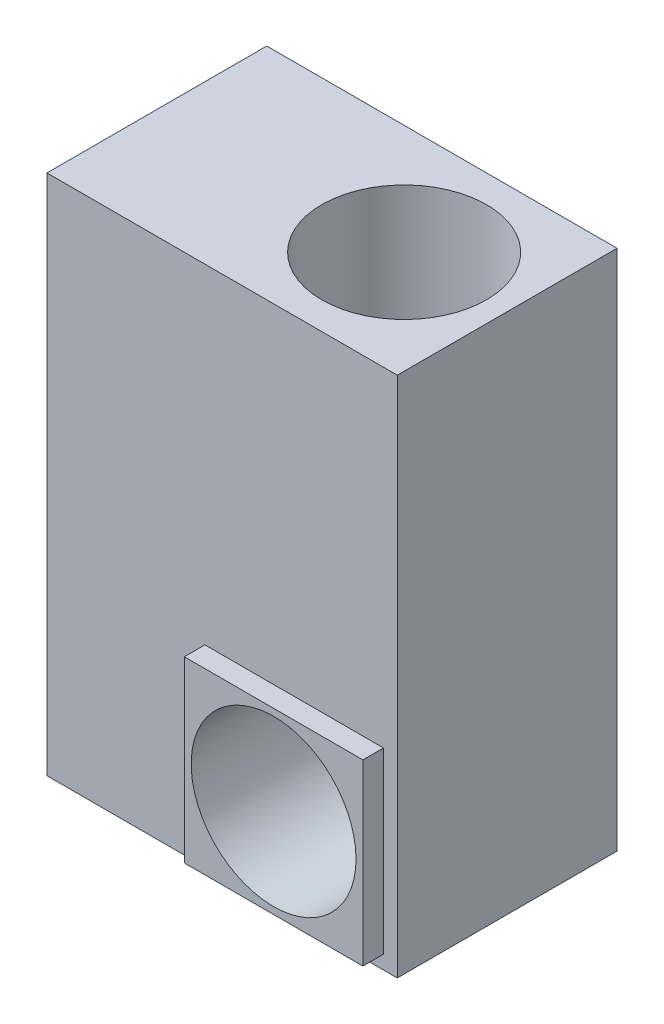
ISO-10303-21;
HEADER;
FILE_DESCRIPTION(('STEP AP214'),'2;1');
FILE_NAME('part.step','',(''),(''),'','','');
FILE_SCHEMA(('AUTOMOTIVE_DESIGN { 1 0 10303 214 1 1 1 1 }'));
ENDSEC;
DATA;
#1=APPLICATION_CONTEXT('core data for automotive mechanical design processes');
#2=APPLICATION_PROTOCOL_DEFINITION('international standard','automotive_design',2000,#1);
#3=PRODUCT_CONTEXT('',#1,'mechanical');
#4=PRODUCT('Part','Part','',(#3));
#5=PRODUCT_RELATED_PRODUCT_CATEGORY('part','',(#4));
#6=PRODUCT_DEFINITION_FORMATION('','',#4);
#7=PRODUCT_DEFINITION_CONTEXT('part definition',#1,'design');
#8=PRODUCT_DEFINITION('design','',#6,#7);
#9=PRODUCT_DEFINITION_SHAPE('','',#8);
#10=(LENGTH_UNIT() NAMED_UNIT(*) SI_UNIT(.MILLI.,.METRE.));
#11=(NAMED_UNIT(*) PLANE_ANGLE_UNIT() SI_UNIT($,.RADIAN.));
#12=(NAMED_UNIT(*) SI_UNIT($,.STERADIAN.) SOLID_ANGLE_UNIT());
#13=UNCERTAINTY_MEASURE_WITH_UNIT(LENGTH_MEASURE(1.E-05),#10,'distance_accuracy_value','');
#14=(GEOMETRIC_REPRESENTATION_CONTEXT(3) GLOBAL_UNCERTAINTY_ASSIGNED_CONTEXT((#13)) GLOBAL_UNIT_ASSIGNED_CONTEXT((#10,
#11,#12)) REPRESENTATION_CONTEXT('',''));
#15=CARTESIAN_POINT('',(0.,0.,0.));
#16=DIRECTION('',(0.,0.,1.));
#17=DIRECTION('',(1.,0.,0.));
#18=AXIS2_PLACEMENT_3D('',#15,#16,#17);
#19=CARTESIAN_POINT('',(77.775,-115.9,52.8));
#20=DIRECTION('',(0.,0.,1.));
#21=DIRECTION('',(1.,0.,0.));
#22=AXIS2_PLACEMENT_3D('',#19,#20,#21);
#23=PLANE('',#22);
#24=DIRECTION('',(0.,1.,0.));
#25=VECTOR('',#24,1.);
#26=CARTESIAN_POINT('',(77.775,-115.9,52.8));
#27=LINE('',#26,#25);
#28=CARTESIAN_POINT('',(77.775,-115.9,52.8));
#29=VERTEX_POINT('',#28);
#30=CARTESIAN_POINT('',(77.775,125.4,52.8));
#31=VERTEX_POINT('',#30);
#32=EDGE_CURVE('E141',#29,#31,#27,.T.);
#33=ORIENTED_EDGE('',*,*,#32,.T.);
#34=DIRECTION('',(-1.,0.,0.));
#35=VECTOR('',#34,1.);
#36=CARTESIAN_POINT('',(77.775,125.4,52.8));
#37=LINE('',#36,#35);
#38=CARTESIAN_POINT('',(-84.15,125.4,52.8));
#39=VERTEX_POINT('',#38);
#40=EDGE_CURVE('E86',#31,#39,#37,.T.);
#41=ORIENTED_EDGE('',*,*,#40,.T.);
#42=DIRECTION('',(0.,-1.,0.));
#43=VECTOR('',#42,1.);
#44=CARTESIAN_POINT('',(-84.15,-115.9,52.8));
#45=LINE('',#44,#43);
#46=CARTESIAN_POINT('',(-84.15,-115.9,52.8));
#47=VERTEX_POINT('',#46);
#48=EDGE_CURVE('E144',#39,#47,#45,.T.);
#49=ORIENTED_EDGE('',*,*,#48,.T.);
#50=DIRECTION('',(1.,0.,0.));
#51=VECTOR('',#50,1.);
#52=CARTESIAN_POINT('',(77.775,-115.9,52.8));
#53=LINE('',#52,#51);
#54=EDGE_CURVE('E58',#47,#29,#53,.T.);
#55=ORIENTED_EDGE('',*,*,#54,.T.);
#56=EDGE_LOOP('',(#33,#41,#49,#55));
#57=FACE_BOUND('',#56,.T.);
#58=DIRECTION('',(-1.,0.,0.));
#59=VECTOR('',#58,1.);
#60=CARTESIAN_POINT('',(71.425,-27.,52.8));
#61=LINE('',#60,#59);
#62=CARTESIAN_POINT('',(71.425,-27.,52.8));
#63=VERTEX_POINT('',#62);
#64=CARTESIAN_POINT('',(-11.125,-27.,52.8));
#65=VERTEX_POINT('',#64);
#66=EDGE_CURVE('E234',#63,#65,#61,.T.);
#67=ORIENTED_EDGE('',*,*,#66,.F.);
#68=DIRECTION('',(0.,1.,0.));
#69=VECTOR('',#68,1.);
#70=CARTESIAN_POINT('',(71.425,-109.55,52.8));
#71=LINE('',#70,#69);
#72=CARTESIAN_POINT('',(71.425,-109.55,52.8));
#73=VERTEX_POINT('',#72);
#74=EDGE_CURVE('E131',#73,#63,#71,.T.);
#75=ORIENTED_EDGE('',*,*,#74,.F.);
#76=DIRECTION('',(1.,0.,0.));
#77=VECTOR('',#76,1.);
#78=CARTESIAN_POINT('',(71.425,-109.55,52.8));
#79=LINE('',#78,#77);
#80=CARTESIAN_POINT('',(-11.125,-109.55,52.8));
#81=VERTEX_POINT('',#80);
#82=EDGE_CURVE('E127',#81,#73,#79,.T.);
#83=ORIENTED_EDGE('',*,*,#82,.F.);
#84=DIRECTION('',(0.,-1.,0.));
#85=VECTOR('',#84,1.);
#86=CARTESIAN_POINT('',(-11.125,-109.55,52.8));
#87=LINE('',#86,#85);
#88=EDGE_CURVE('E236',#65,#81,#87,.T.);
#89=ORIENTED_EDGE('',*,*,#88,.F.);
#90=EDGE_LOOP('',(#67,#75,#83,#89));
#91=FACE_BOUND('',#90,.T.);
#92=ADVANCED_FACE('F34',(#57,#91),#23,.T.);
#93=CARTESIAN_POINT('',(77.775,-115.9,52.8));
#94=DIRECTION('',(-1.,0.,0.));
#95=DIRECTION('',(0.,0.,1.));
#96=AXIS2_PLACEMENT_3D('',#93,#94,#95);
#97=PLANE('',#96);
#98=DIRECTION('',(0.,1.,0.));
#99=VECTOR('',#98,1.);
#100=CARTESIAN_POINT('',(77.775,-115.9,-48.8));
#101=LINE('',#100,#99);
#102=CARTESIAN_POINT('',(77.775,-115.9,-48.8));
#103=VERTEX_POINT('',#102);
#104=CARTESIAN_POINT('',(77.775,125.4,-48.8));
#105=VERTEX_POINT('',#104);
#106=EDGE_CURVE('E133',#103,#105,#101,.T.);
#107=ORIENTED_EDGE('',*,*,#106,.T.);
#108=DIRECTION('',(0.,0.,-1.));
#109=VECTOR('',#108,1.);
#110=CARTESIAN_POINT('',(77.775,125.4,52.8));
#111=LINE('',#110,#109);
#112=EDGE_CURVE('E11',#31,#105,#111,.T.);
#113=ORIENTED_EDGE('',*,*,#112,.F.);
#114=ORIENTED_EDGE('',*,*,#32,.F.);
#115=DIRECTION('',(0.,0.,-1.));
#116=VECTOR('',#115,1.);
#117=CARTESIAN_POINT('',(77.775,-115.9,52.8));
#118=LINE('',#117,#116);
#119=EDGE_CURVE('E146',#29,#103,#118,.T.);
#120=ORIENTED_EDGE('',*,*,#119,.T.);
#121=EDGE_LOOP('',(#107,#113,#114,#120));
#122=FACE_BOUND('',#121,.T.);
#123=ADVANCED_FACE('F36',(#122),#97,.F.);
#124=CARTESIAN_POINT('',(77.775,125.4,52.8));
#125=DIRECTION('',(0.,-1.,0.));
#126=DIRECTION('',(0.,0.,-1.));
#127=AXIS2_PLACEMENT_3D('',#124,#125,#126);
#128=PLANE('',#127);
#129=CARTESIAN_POINT('',(30.15,125.4,2.));
#130=DIRECTION('',(0.,1.,0.));
#131=DIRECTION('',(0.,0.,1.));
#132=AXIS2_PLACEMENT_3D('',#129,#130,#131);
#133=CIRCLE('',#132,38.1);
#134=CARTESIAN_POINT('',(30.15,125.4,40.1));
#135=VERTEX_POINT('',#134);
#136=EDGE_CURVE('E220',#135,#135,#133,.T.);
#137=ORIENTED_EDGE('',*,*,#136,.F.);
#138=EDGE_LOOP('',(#137));
#139=FACE_BOUND('',#138,.T.);
#140=DIRECTION('',(-1.,0.,0.));
#141=VECTOR('',#140,1.);
#142=CARTESIAN_POINT('',(77.775,125.4,-48.8));
#143=LINE('',#142,#141);
#144=CARTESIAN_POINT('',(-84.15,125.4,-48.8));
#145=VERTEX_POINT('',#144);
#146=EDGE_CURVE('E136',#105,#145,#143,.T.);
#147=ORIENTED_EDGE('',*,*,#146,.T.);
#148=DIRECTION('',(0.,0.,-1.));
#149=VECTOR('',#148,1.);
#150=CARTESIAN_POINT('',(-84.15,125.4,52.8));
#151=LINE('',#150,#149);
#152=EDGE_CURVE('E42',#39,#145,#151,.T.);
#153=ORIENTED_EDGE('',*,*,#152,.F.);
#154=ORIENTED_EDGE('',*,*,#40,.F.);
#155=ORIENTED_EDGE('',*,*,#112,.T.);
#156=EDGE_LOOP('',(#147,#153,#154,#155));
#157=FACE_BOUND('',#156,.T.);
#158=ADVANCED_FACE('F174',(#139,#157),#128,.F.);
#159=CARTESIAN_POINT('',(-84.15,-115.9,52.8));
#160=DIRECTION('',(1.,0.,0.));
#161=DIRECTION('',(0.,0.,-1.));
#162=AXIS2_PLACEMENT_3D('',#159,#160,#161);
#163=PLANE('',#162);
#164=DIRECTION('',(0.,-1.,0.));
#165=VECTOR('',#164,1.);
#166=CARTESIAN_POINT('',(-84.15,-115.9,-48.8));
#167=LINE('',#166,#165);
#168=CARTESIAN_POINT('',(-84.15,-115.9,-48.8));
#169=VERTEX_POINT('',#168);
#170=EDGE_CURVE('E149',#145,#169,#167,.T.);
#171=ORIENTED_EDGE('',*,*,#170,.T.);
#172=DIRECTION('',(0.,0.,-1.));
#173=VECTOR('',#172,1.);
#174=CARTESIAN_POINT('',(-84.15,-115.9,52.8));
#175=LINE('',#174,#173);
#176=EDGE_CURVE('E153',#47,#169,#175,.T.);
#177=ORIENTED_EDGE('',*,*,#176,.F.);
#178=ORIENTED_EDGE('',*,*,#48,.F.);
#179=ORIENTED_EDGE('',*,*,#152,.T.);
#180=EDGE_LOOP('',(#171,#177,#178,#179));
#181=FACE_BOUND('',#180,.T.);
#182=ADVANCED_FACE('F158',(#181),#163,.F.);
#183=CARTESIAN_POINT('',(77.775,-115.9,52.8));
#184=DIRECTION('',(0.,1.,0.));
#185=DIRECTION('',(-1.,0.,0.));
#186=AXIS2_PLACEMENT_3D('',#183,#184,#185);
#187=PLANE('',#186);
#188=DIRECTION('',(1.,0.,0.));
#189=VECTOR('',#188,1.);
#190=CARTESIAN_POINT('',(77.775,-115.9,-48.8));
#191=LINE('',#190,#189);
#192=EDGE_CURVE('E79',#169,#103,#191,.T.);
#193=ORIENTED_EDGE('',*,*,#192,.T.);
#194=ORIENTED_EDGE('',*,*,#119,.F.);
#195=ORIENTED_EDGE('',*,*,#54,.F.);
#196=ORIENTED_EDGE('',*,*,#176,.T.);
#197=EDGE_LOOP('',(#193,#194,#195,#196));
#198=FACE_BOUND('',#197,.T.);
#199=ADVANCED_FACE('F166',(#198),#187,.F.);
#200=CARTESIAN_POINT('',(77.775,-115.9,-48.8));
#201=DIRECTION('',(0.,0.,1.));
#202=DIRECTION('',(1.,0.,0.));
#203=AXIS2_PLACEMENT_3D('',#200,#201,#202);
#204=PLANE('',#203);
#205=ORIENTED_EDGE('',*,*,#106,.F.);
#206=ORIENTED_EDGE('',*,*,#192,.F.);
#207=ORIENTED_EDGE('',*,*,#170,.F.);
#208=ORIENTED_EDGE('',*,*,#146,.F.);
#209=EDGE_LOOP('',(#205,#206,#207,#208));
#210=FACE_BOUND('',#209,.T.);
#211=ADVANCED_FACE('F162',(#210),#204,.F.);
#212=CARTESIAN_POINT('',(71.425,-109.55,62.325));
#213=DIRECTION('',(-1.,0.,0.));
#214=DIRECTION('',(0.,0.,1.));
#215=AXIS2_PLACEMENT_3D('',#212,#213,#214);
#216=PLANE('',#215);
#217=ORIENTED_EDGE('',*,*,#74,.T.);
#218=DIRECTION('',(0.,0.,-1.));
#219=VECTOR('',#218,1.);
#220=CARTESIAN_POINT('',(71.425,-27.,62.325));
#221=LINE('',#220,#219);
#222=CARTESIAN_POINT('',(71.425,-27.,62.325));
#223=VERTEX_POINT('',#222);
#224=EDGE_CURVE('E112',#223,#63,#221,.T.);
#225=ORIENTED_EDGE('',*,*,#224,.F.);
#226=DIRECTION('',(0.,1.,0.));
#227=VECTOR('',#226,1.);
#228=CARTESIAN_POINT('',(71.425,-109.55,62.325));
#229=LINE('',#228,#227);
#230=CARTESIAN_POINT('',(71.425,-109.55,62.325));
#231=VERTEX_POINT('',#230);
#232=EDGE_CURVE('E119',#231,#223,#229,.T.);
#233=ORIENTED_EDGE('',*,*,#232,.F.);
#234=DIRECTION('',(0.,0.,-1.));
#235=VECTOR('',#234,1.);
#236=CARTESIAN_POINT('',(71.425,-109.55,62.325));
#237=LINE('',#236,#235);
#238=EDGE_CURVE('E232',#231,#73,#237,.T.);
#239=ORIENTED_EDGE('',*,*,#238,.T.);
#240=EDGE_LOOP('',(#217,#225,#233,#239));
#241=FACE_BOUND('',#240,.T.);
#242=ADVANCED_FACE('F129',(#241),#216,.F.);
#243=CARTESIAN_POINT('',(71.425,-27.,62.325));
#244=DIRECTION('',(0.,-1.,0.));
#245=DIRECTION('',(1.,0.,0.));
#246=AXIS2_PLACEMENT_3D('',#243,#244,#245);
#247=PLANE('',#246);
#248=ORIENTED_EDGE('',*,*,#66,.T.);
#249=DIRECTION('',(0.,0.,-1.));
#250=VECTOR('',#249,1.);
#251=CARTESIAN_POINT('',(-11.125,-27.,62.325));
#252=LINE('',#251,#250);
#253=CARTESIAN_POINT('',(-11.125,-27.,62.325));
#254=VERTEX_POINT('',#253);
#255=EDGE_CURVE('E115',#254,#65,#252,.T.);
#256=ORIENTED_EDGE('',*,*,#255,.F.);
#257=DIRECTION('',(-1.,0.,0.));
#258=VECTOR('',#257,1.);
#259=CARTESIAN_POINT('',(71.425,-27.,62.325));
#260=LINE('',#259,#258);
#261=EDGE_CURVE('E108',#223,#254,#260,.T.);
#262=ORIENTED_EDGE('',*,*,#261,.F.);
#263=ORIENTED_EDGE('',*,*,#224,.T.);
#264=EDGE_LOOP('',(#248,#256,#262,#263));
#265=FACE_BOUND('',#264,.T.);
#266=ADVANCED_FACE('F110',(#265),#247,.F.);
#267=CARTESIAN_POINT('',(-11.125,-109.55,62.325));
#268=DIRECTION('',(1.,0.,0.));
#269=DIRECTION('',(0.,0.,-1.));
#270=AXIS2_PLACEMENT_3D('',#267,#268,#269);
#271=PLANE('',#270);
#272=ORIENTED_EDGE('',*,*,#88,.T.);
#273=DIRECTION('',(0.,0.,-1.));
#274=VECTOR('',#273,1.);
#275=CARTESIAN_POINT('',(-11.125,-109.55,62.325));
#276=LINE('',#275,#274);
#277=CARTESIAN_POINT('',(-11.125,-109.55,62.325));
#278=VERTEX_POINT('',#277);
#279=EDGE_CURVE('E49',#278,#81,#276,.T.);
#280=ORIENTED_EDGE('',*,*,#279,.F.);
#281=DIRECTION('',(0.,-1.,0.));
#282=VECTOR('',#281,1.);
#283=CARTESIAN_POINT('',(-11.125,-109.55,62.325));
#284=LINE('',#283,#282);
#285=EDGE_CURVE('E118',#254,#278,#284,.T.);
#286=ORIENTED_EDGE('',*,*,#285,.F.);
#287=ORIENTED_EDGE('',*,*,#255,.T.);
#288=EDGE_LOOP('',(#272,#280,#286,#287));
#289=FACE_BOUND('',#288,.T.);
#290=ADVANCED_FACE('F189',(#289),#271,.F.);
#291=CARTESIAN_POINT('',(71.425,-109.55,62.325));
#292=DIRECTION('',(0.,1.,0.));
#293=DIRECTION('',(-1.,0.,0.));
#294=AXIS2_PLACEMENT_3D('',#291,#292,#293);
#295=PLANE('',#294);
#296=ORIENTED_EDGE('',*,*,#82,.T.);
#297=ORIENTED_EDGE('',*,*,#238,.F.);
#298=DIRECTION('',(1.,0.,0.));
#299=VECTOR('',#298,1.);
#300=CARTESIAN_POINT('',(71.425,-109.55,62.325));
#301=LINE('',#300,#299);
#302=EDGE_CURVE('E123',#278,#231,#301,.T.);
#303=ORIENTED_EDGE('',*,*,#302,.F.);
#304=ORIENTED_EDGE('',*,*,#279,.T.);
#305=EDGE_LOOP('',(#296,#297,#303,#304));
#306=FACE_BOUND('',#305,.T.);
#307=ADVANCED_FACE('F192',(#306),#295,.F.);
#308=CARTESIAN_POINT('',(0.,0.,62.325));
#309=DIRECTION('',(0.,0.,1.));
#310=DIRECTION('',(1.,0.,0.));
#311=AXIS2_PLACEMENT_3D('',#308,#309,#310);
#312=PLANE('',#311);
#313=CARTESIAN_POINT('',(30.15,-68.275,62.325));
#314=DIRECTION('',(0.,0.,1.));
#315=DIRECTION('',(1.,0.,0.));
#316=AXIS2_PLACEMENT_3D('',#313,#314,#315);
#317=CIRCLE('',#316,38.1);
#318=CARTESIAN_POINT('',(68.25,-68.275,62.325));
#319=VERTEX_POINT('',#318);
#320=EDGE_CURVE('E219',#319,#319,#317,.T.);
#321=ORIENTED_EDGE('',*,*,#320,.F.);
#322=EDGE_LOOP('',(#321));
#323=FACE_BOUND('',#322,.T.);
#324=ORIENTED_EDGE('',*,*,#232,.T.);
#325=ORIENTED_EDGE('',*,*,#261,.T.);
#326=ORIENTED_EDGE('',*,*,#285,.T.);
#327=ORIENTED_EDGE('',*,*,#302,.T.);
#328=EDGE_LOOP('',(#324,#325,#326,#327));
#329=FACE_BOUND('',#328,.T.);
#330=ADVANCED_FACE('F122',(#323,#329),#312,.T.);
#331=CARTESIAN_POINT('',(30.15,-68.275,-39.275));
#332=DIRECTION('',(0.,0.,1.));
#333=DIRECTION('',(1.,0.,0.));
#334=AXIS2_PLACEMENT_3D('',#331,#332,#333);
#335=CYLINDRICAL_SURFACE('',#334,38.1);
#336=CARTESIAN_POINT('',(30.15,-68.275,-39.275));
#337=DIRECTION('',(0.,0.,1.));
#338=DIRECTION('',(1.,0.,0.));
#339=AXIS2_PLACEMENT_3D('',#336,#337,#338);
#340=CIRCLE('',#339,38.1);
#341=CARTESIAN_POINT('',(68.25,-68.275,-39.275));
#342=VERTEX_POINT('',#341);
#343=EDGE_CURVE('E223',#342,#342,#340,.T.);
#344=ORIENTED_EDGE('',*,*,#343,.F.);
#345=EDGE_LOOP('',(#344));
#346=FACE_BOUND('',#345,.T.);
#347=ORIENTED_EDGE('',*,*,#320,.T.);
#348=EDGE_LOOP('',(#347));
#349=FACE_BOUND('',#348,.T.);
#350=ADVANCED_FACE('F198',(#346,#349),#335,.F.);
#351=CARTESIAN_POINT('',(30.15,-68.275,-39.275));
#352=DIRECTION('',(0.,0.,1.));
#353=DIRECTION('',(1.,0.,0.));
#354=AXIS2_PLACEMENT_3D('',#351,#352,#353);
#355=PLANE('',#354);
#356=ORIENTED_EDGE('',*,*,#343,.T.);
#357=EDGE_LOOP('',(#356));
#358=FACE_BOUND('',#357,.T.);
#359=ADVANCED_FACE('F202',(#358),#355,.T.);
#360=CARTESIAN_POINT('',(30.15,23.8,2.));
#361=DIRECTION('',(0.,1.,0.));
#362=DIRECTION('',(0.,0.,1.));
#363=AXIS2_PLACEMENT_3D('',#360,#361,#362);
#364=CYLINDRICAL_SURFACE('',#363,38.1);
#365=CARTESIAN_POINT('',(30.15,23.8,2.));
#366=DIRECTION('',(0.,1.,0.));
#367=DIRECTION('',(0.,0.,1.));
#368=AXIS2_PLACEMENT_3D('',#365,#366,#367);
#369=CIRCLE('',#368,38.1);
#370=CARTESIAN_POINT('',(30.15,23.8,40.1));
#371=VERTEX_POINT('',#370);
#372=EDGE_CURVE('E218',#371,#371,#369,.T.);
#373=ORIENTED_EDGE('',*,*,#372,.F.);
#374=EDGE_LOOP('',(#373));
#375=FACE_BOUND('',#374,.T.);
#376=ORIENTED_EDGE('',*,*,#136,.T.);
#377=EDGE_LOOP('',(#376));
#378=FACE_BOUND('',#377,.T.);
#379=ADVANCED_FACE('F206',(#375,#378),#364,.F.);
#380=CARTESIAN_POINT('',(30.15,23.8,2.));
#381=DIRECTION('',(0.,1.,0.));
#382=DIRECTION('',(0.,0.,1.));
#383=AXIS2_PLACEMENT_3D('',#380,#381,#382);
#384=PLANE('',#383);
#385=ORIENTED_EDGE('',*,*,#372,.T.);
#386=EDGE_LOOP('',(#385));
#387=FACE_BOUND('',#386,.T.);
#388=ADVANCED_FACE('F210',(#387),#384,.T.);
#389=CLOSED_SHELL('',(#92,#123,#158,#182,#199,#211,#242,#266,#290,#307,#330,#350,#359,#379,#388));
#390=MANIFOLD_SOLID_BREP('B2',#389);
#391=ADVANCED_BREP_SHAPE_REPRESENTATION('',(#18,#390),#14);
#392=SHAPE_DEFINITION_REPRESENTATION(#9,#391);
ENDSEC;
END-ISO-10303-21;
